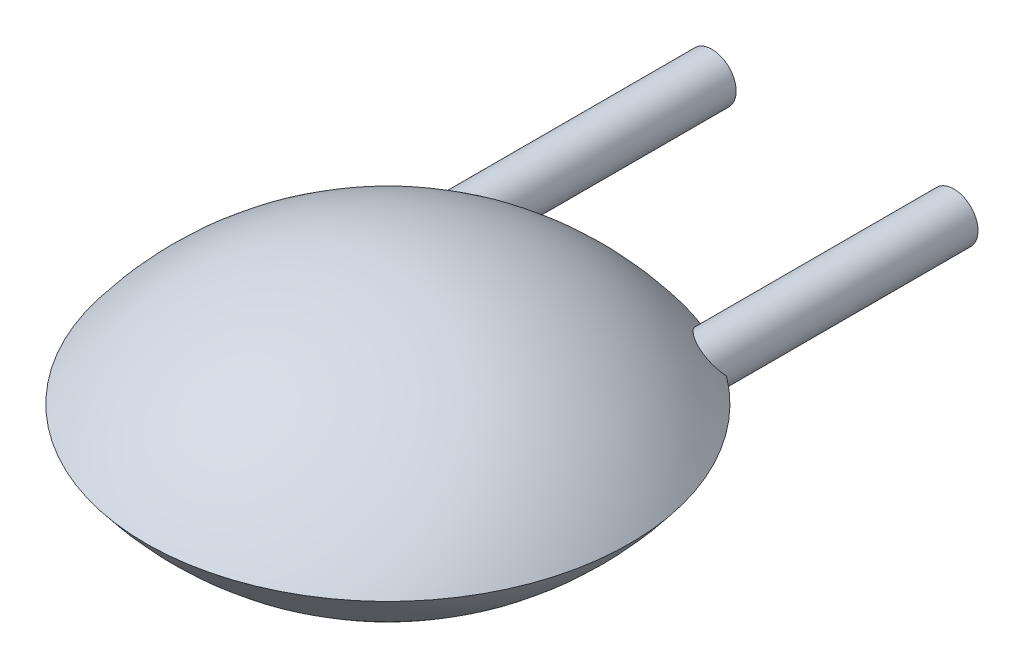
ISO-10303-21;
HEADER;
FILE_DESCRIPTION(('STEP AP214'),'2;1');
FILE_NAME('part.step','',(''),(''),'','','');
FILE_SCHEMA(('AUTOMOTIVE_DESIGN { 1 0 10303 214 1 1 1 1 }'));
ENDSEC;
DATA;
#1=APPLICATION_CONTEXT('core data for automotive mechanical design processes');
#2=APPLICATION_PROTOCOL_DEFINITION('international standard','automotive_design',2000,#1);
#3=PRODUCT_CONTEXT('',#1,'mechanical');
#4=PRODUCT('Part','Part','',(#3));
#5=PRODUCT_RELATED_PRODUCT_CATEGORY('part','',(#4));
#6=PRODUCT_DEFINITION_FORMATION('','',#4);
#7=PRODUCT_DEFINITION_CONTEXT('part definition',#1,'design');
#8=PRODUCT_DEFINITION('design','',#6,#7);
#9=PRODUCT_DEFINITION_SHAPE('','',#8);
#10=(LENGTH_UNIT() NAMED_UNIT(*) SI_UNIT(.MILLI.,.METRE.));
#11=(NAMED_UNIT(*) PLANE_ANGLE_UNIT() SI_UNIT($,.RADIAN.));
#12=(NAMED_UNIT(*) SI_UNIT($,.STERADIAN.) SOLID_ANGLE_UNIT());
#13=UNCERTAINTY_MEASURE_WITH_UNIT(LENGTH_MEASURE(1.E-05),#10,'distance_accuracy_value','');
#14=(GEOMETRIC_REPRESENTATION_CONTEXT(3) GLOBAL_UNCERTAINTY_ASSIGNED_CONTEXT((#13)) GLOBAL_UNIT_ASSIGNED_CONTEXT((#10,
#11,#12)) REPRESENTATION_CONTEXT('',''));
#15=CARTESIAN_POINT('',(0.,0.,0.));
#16=DIRECTION('',(0.,0.,1.));
#17=DIRECTION('',(1.,0.,0.));
#18=AXIS2_PLACEMENT_3D('',#15,#16,#17);
#19=CARTESIAN_POINT('',(2.755,0.25,-2.));
#20=DIRECTION('',(0.,0.,-1.));
#21=DIRECTION('',(0.,-1.,0.));
#22=AXIS2_PLACEMENT_3D('',#19,#20,#21);
#23=PLANE('',#22);
#24=CARTESIAN_POINT('',(2.5,-1.26661918800619E-13,-2.));
#25=DIRECTION('',(0.,0.,-1.));
#26=DIRECTION('',(-1.,0.,0.));
#27=AXIS2_PLACEMENT_3D('',#24,#25,#26);
#28=CIRCLE('',#27,0.249999999999979);
#29=CARTESIAN_POINT('',(2.25000000000002,-1.26661918800619E-13,-2.));
#30=VERTEX_POINT('',#29);
#31=EDGE_CURVE('E51',#30,#30,#28,.F.);
#32=ORIENTED_EDGE('',*,*,#31,.F.);
#33=EDGE_LOOP('',(#32));
#34=FACE_BOUND('',#33,.T.);
#35=ADVANCED_FACE('F17',(#34),#23,.T.);
#36=CARTESIAN_POINT('',(-0.255,-0.25,-2.));
#37=DIRECTION('',(0.,0.,-1.));
#38=DIRECTION('',(0.,1.,0.));
#39=AXIS2_PLACEMENT_3D('',#36,#37,#38);
#40=PLANE('',#39);
#41=CARTESIAN_POINT('',(0.,1.26580603637683E-13,-2.));
#42=DIRECTION('',(0.,0.,-1.));
#43=DIRECTION('',(-1.,0.,0.));
#44=AXIS2_PLACEMENT_3D('',#41,#42,#43);
#45=CIRCLE('',#44,0.249999999999979);
#46=CARTESIAN_POINT('',(-0.249999999999979,1.26580603637683E-13,-2.));
#47=VERTEX_POINT('',#46);
#48=EDGE_CURVE('E90',#47,#47,#45,.F.);
#49=ORIENTED_EDGE('',*,*,#48,.F.);
#50=EDGE_LOOP('',(#49));
#51=FACE_BOUND('',#50,.T.);
#52=ADVANCED_FACE('F87',(#51),#40,.T.);
#53=CARTESIAN_POINT('',(2.5,-1.26661918800619E-13,0.729876662499));
#54=DIRECTION('',(0.,0.,-1.));
#55=DIRECTION('',(-1.,0.,0.));
#56=AXIS2_PLACEMENT_3D('',#53,#54,#55);
#57=CYLINDRICAL_SURFACE('',#56,0.249999999999979);
#58=CARTESIAN_POINT('',(2.74999999999998,1.10598110046265E-13,0.600000000000105));
#59=CARTESIAN_POINT('',(2.74996831500516,0.0152953630539708,0.614307261235111));
#60=CARTESIAN_POINT('',(2.74858650443059,0.031069132342929,0.628397485276167));
#61=CARTESIAN_POINT('',(2.74241563227304,0.0633614647499166,0.655385017296721));
#62=CARTESIAN_POINT('',(2.73757398831808,0.0798877902622742,0.66826040049759));
#63=CARTESIAN_POINT('',(2.72684027747434,0.105546588593836,0.686327406929106));
#64=CARTESIAN_POINT('',(2.72239459439526,0.114669020400689,0.692374307778562));
#65=CARTESIAN_POINT('',(2.71211410354781,0.132721751452659,0.703414113960098));
#66=CARTESIAN_POINT('',(2.70628564248961,0.141652730997912,0.708411643755682));
#67=CARTESIAN_POINT('',(2.6941822339536,0.157727357116136,0.716365139998048));
#68=CARTESIAN_POINT('',(2.68811994009843,0.164931969807166,0.719518215902648));
#69=CARTESIAN_POINT('',(2.67496916543412,0.178821287038767,0.7246323398921));
#70=CARTESIAN_POINT('',(2.6678809088678,0.185506104700465,0.72659364797382));
#71=CARTESIAN_POINT('',(2.65277445487178,0.198134533471485,0.729154972080429));
#72=CARTESIAN_POINT('',(2.64475138803358,0.204073895209916,0.729747491719958));
#73=CARTESIAN_POINT('',(2.62806749270661,0.214936675441072,0.729487035437101));
#74=CARTESIAN_POINT('',(2.61940672773521,0.219860194930648,0.728634203291928));
#75=CARTESIAN_POINT('',(2.60256843545302,0.228166345186264,0.725711624186338));
#76=CARTESIAN_POINT('',(2.59441845320567,0.231648306776192,0.723759427238487));
#77=CARTESIAN_POINT('',(2.57806493413321,0.237659141657605,0.718877508051946));
#78=CARTESIAN_POINT('',(2.56986138065098,0.240187702594835,0.715947466042133));
#79=CARTESIAN_POINT('',(2.55111655290198,0.244962477245274,0.708276469800053));
#80=CARTESIAN_POINT('',(2.54061110523447,0.246897236480397,0.703255970411835));
#81=CARTESIAN_POINT('',(2.51998856476029,0.249416858689239,0.692188084747817));
#82=CARTESIAN_POINT('',(2.50987214879625,0.249999465171378,0.68613899997886));
#83=CARTESIAN_POINT('',(2.4821586852701,0.250000966561776,0.668101274239286));
#84=CARTESIAN_POINT('',(2.46511517309169,0.248100825191583,0.65525977920515));
#85=CARTESIAN_POINT('',(2.43280344181189,0.241367659280467,0.628186466608448));
#86=CARTESIAN_POINT('',(2.41754207496661,0.236523731819275,0.613949646372646));
#87=CARTESIAN_POINT('',(2.38476260927401,0.22275379214357,0.580565175806371));
#88=CARTESIAN_POINT('',(2.36782405961647,0.213061352044565,0.561165971981635));
#89=CARTESIAN_POINT('',(2.33696060599022,0.190482829774047,0.521857549280326));
#90=CARTESIAN_POINT('',(2.32303769647562,0.177594646043372,0.501948002552135));
#91=CARTESIAN_POINT('',(2.29815091626633,0.148751920045031,0.461726012037251));
#92=CARTESIAN_POINT('',(2.2872531473187,0.132740228530098,0.441413628118798));
#93=CARTESIAN_POINT('',(2.26926302727932,0.0981755640070862,0.401345191382363));
#94=CARTESIAN_POINT('',(2.26215835437199,0.0796310683943441,0.381587537169254));
#95=CARTESIAN_POINT('',(2.25495337454237,0.0504773630747672,0.35313256656374));
#96=CARTESIAN_POINT('',(2.25313049731494,0.0407118377338322,0.343989300033733));
#97=CARTESIAN_POINT('',(2.25065545697635,0.0207016797178923,0.326058287401227));
#98=CARTESIAN_POINT('',(2.25000446897692,0.0104565766935262,0.31727090678202));
#99=CARTESIAN_POINT('',(2.25000000000002,0.,0.308712152522103));
#100=B_SPLINE_CURVE_WITH_KNOTS('',3,(#58,#59,#60,#61,#62,#63,#64,#65,#66,#67,#68,#69,#70,#71,
#72,#73,#74,#75,#76,#77,#78,#79,#80,#81,#82,#83,#84,#85,#86,#87,#88,#89,#90,#91,#92,#93,#94,#95,
#96,#97,#98,#99),.UNSPECIFIED.,.F.,.F.,(4,2,2,2,2,2,2,2,2,2,2,2,2,2,2,2,2,2,2,2,4),(0.,
0.0631169965110015,0.127214219304128,0.162547660109247,0.19772196138693,0.227391076018448,
0.257053715689979,0.286878426235301,0.316700170124245,0.343813602857831,0.370935910824025,
0.406182541375689,0.441487949837896,0.505293198022049,0.569336214671407,0.651462563020561,
0.733643062538741,0.817498720668084,0.901080291432049,0.941528484933224,0.982017215308659),.UNSPECIFIED.);
#101=CARTESIAN_POINT('',(2.74999999999998,0.,0.599999999999925));
#102=VERTEX_POINT('',#101);
#103=CARTESIAN_POINT('',(2.25000000000002,0.,0.308712152522124));
#104=VERTEX_POINT('',#103);
#105=EDGE_CURVE('E52',#102,#104,#100,.T.);
#106=ORIENTED_EDGE('',*,*,#105,.F.);
#107=CARTESIAN_POINT('',(2.74999999999998,0.,0.599999999999928));
#108=CARTESIAN_POINT('',(2.74996831500519,-0.0152953630537775,0.614307261234947));
#109=CARTESIAN_POINT('',(2.74858650443064,-0.0310691323427305,0.628397485276018));
#110=CARTESIAN_POINT('',(2.74241563227316,-0.0633614647497012,0.655385017296599));
#111=CARTESIAN_POINT('',(2.73757398831824,-0.0798877902620471,0.668260400497483));
#112=CARTESIAN_POINT('',(2.72684027747456,-0.105546588593617,0.68632740692905));
#113=CARTESIAN_POINT('',(2.7223945943955,-0.114669020400487,0.692374307778533));
#114=CARTESIAN_POINT('',(2.71211410354807,-0.132721751452498,0.703414113960129));
#115=CARTESIAN_POINT('',(2.70628564248988,-0.141652730997774,0.708411643755745));
#116=CARTESIAN_POINT('',(2.69418223395388,-0.15772735711604,0.716365139998164));
#117=CARTESIAN_POINT('',(2.68811994009872,-0.164931969807089,0.719518215902787));
#118=CARTESIAN_POINT('',(2.67496916543443,-0.178821287038722,0.724632339892283));
#119=CARTESIAN_POINT('',(2.66788090886811,-0.185506104700434,0.726593647974025));
#120=CARTESIAN_POINT('',(2.65277445487211,-0.198134533471486,0.729154972080675));
#121=CARTESIAN_POINT('',(2.64475138803392,-0.204073895209935,0.729747491720224));
#122=CARTESIAN_POINT('',(2.62806749270694,-0.214936675441125,0.729487035437411));
#123=CARTESIAN_POINT('',(2.61940672773552,-0.219860194930715,0.728634203292258));
#124=CARTESIAN_POINT('',(2.60256843545332,-0.228166345186402,0.725711624186682));
#125=CARTESIAN_POINT('',(2.59441845320596,-0.231648306776382,0.723759427238826));
#126=CARTESIAN_POINT('',(2.57806493413348,-0.237659141657717,0.718877508052341));
#127=CARTESIAN_POINT('',(2.56986138065123,-0.240187702594819,0.715947466042593));
#128=CARTESIAN_POINT('',(2.55111655289833,-0.244962477246725,0.708276469798746));
#129=CARTESIAN_POINT('',(2.54061110522705,-0.246897236483079,0.703255970408097));
#130=CARTESIAN_POINT('',(2.51998856474469,-0.249416858689874,0.692188084739765));
#131=CARTESIAN_POINT('',(2.50987214877623,-0.249999465168716,0.686138999968918));
#132=CARTESIAN_POINT('',(2.48215868524657,-0.250000966554099,0.668101274226046));
#133=CARTESIAN_POINT('',(2.46511517306997,-0.248100825187097,0.655259779189424));
#134=CARTESIAN_POINT('',(2.43280344179273,-0.241367659276937,0.628186466590453));
#135=CARTESIAN_POINT('',(2.41754207494816,-0.236523731813532,0.613949646354896));
#136=CARTESIAN_POINT('',(2.38476260925645,-0.2227537921342,0.580565175787766));
#137=CARTESIAN_POINT('',(2.36782405959933,-0.213061352034087,0.561165971961759));
#138=CARTESIAN_POINT('',(2.33696060597393,-0.190482829760578,0.52185754925814));
#139=CARTESIAN_POINT('',(2.3230376964598,-0.177594646027992,0.501948002528908));
#140=CARTESIAN_POINT('',(2.29815091625208,-0.148751920025999,0.461726012012306));
#141=CARTESIAN_POINT('',(2.28725314730551,-0.13274022850936,0.441413628093178));
#142=CARTESIAN_POINT('',(2.26926302726884,-0.0981755639828915,0.401345191355763));
#143=CARTESIAN_POINT('',(2.26215835436313,-0.0796310683684121,0.381587537142346));
#144=CARTESIAN_POINT('',(2.25495337453765,-0.0504773630512487,0.353132566541518));
#145=CARTESIAN_POINT('',(2.25313049731194,-0.040711837714699,0.343989300016192));
#146=CARTESIAN_POINT('',(2.2506554569757,-0.0207016797080085,0.326058287392739));
#147=CARTESIAN_POINT('',(2.2500044689769,-0.0104565766885065,0.317270906777905));
#148=CARTESIAN_POINT('',(2.25000000000002,0.,0.308712152522146));
#149=B_SPLINE_CURVE_WITH_KNOTS('',3,(#107,#108,#109,#110,#111,#112,#113,#114,#115,#116,#117,
#118,#119,#120,#121,#122,#123,#124,#125,#126,#127,#128,#129,#130,#131,#132,#133,#134,#135,#136,
#137,#138,#139,#140,#141,#142,#143,#144,#145,#146,#147,#148),.UNSPECIFIED.,.F.,.F.,(4,2,2,2,2,2,
2,2,2,2,2,2,2,2,2,2,2,2,2,2,4),(0.,0.0631169965110145,0.127214219304117,0.162547660109303,
0.197721961387065,0.227391076018632,0.257053715690189,0.286878426235521,0.316700170124534,
0.343813602858168,0.370935910824307,0.406182541389356,0.441487949865298,0.505293198049375,
0.569336214697787,0.651462563050332,0.733643062572599,0.817498720705076,0.901080291471782,
0.941528484953319,0.982017215309143),.UNSPECIFIED.);
#150=EDGE_CURVE('E22',#102,#104,#149,.T.);
#151=ORIENTED_EDGE('',*,*,#150,.T.);
#152=EDGE_LOOP('',(#106,#151));
#153=FACE_BOUND('',#152,.T.);
#154=ORIENTED_EDGE('',*,*,#31,.T.);
#155=EDGE_LOOP('',(#154));
#156=FACE_BOUND('',#155,.T.);
#157=ADVANCED_FACE('F53',(#153,#156),#57,.T.);
#158=CARTESIAN_POINT('',(0.,1.26580603637683E-13,0.75717542912601));
#159=DIRECTION('',(0.,0.,-1.));
#160=DIRECTION('',(-1.,0.,0.));
#161=AXIS2_PLACEMENT_3D('',#158,#159,#160);
#162=CYLINDRICAL_SURFACE('',#161,0.249999999999979);
#163=ORIENTED_EDGE('',*,*,#48,.T.);
#164=EDGE_LOOP('',(#163));
#165=FACE_BOUND('',#164,.T.);
#166=CARTESIAN_POINT('',(0.249999999999979,0.,0.308712152522128));
#167=CARTESIAN_POINT('',(0.24997488827417,0.0164350278058691,0.322170932045068));
#168=CARTESIAN_POINT('',(0.24838247205631,0.0323369222718146,0.336174769257033));
#169=CARTESIAN_POINT('',(0.242477044037619,0.0628308969966721,0.364876576993245));
#170=CARTESIAN_POINT('',(0.238177189604652,0.0774289241226746,0.379570874299972));
#171=CARTESIAN_POINT('',(0.22648109296464,0.107225071677549,0.411530011764898));
#172=CARTESIAN_POINT('',(0.218729500903288,0.122209542447046,0.428861522547737));
#173=CARTESIAN_POINT('',(0.20053732745672,0.1502153658402,0.463802021452636));
#174=CARTESIAN_POINT('',(0.190087495283091,0.163229715559201,0.481411764528911));
#175=CARTESIAN_POINT('',(0.164389568525476,0.189413869016829,0.520068167811574));
#176=CARTESIAN_POINT('',(0.148599067962354,0.202087940462894,0.541093345876465));
#177=CARTESIAN_POINT('',(0.113678976252789,0.223600006324568,0.582298917255407));
#178=CARTESIAN_POINT('',(0.0945586897048824,0.232448457054781,0.602481475295789));
#179=CARTESIAN_POINT('',(0.062461220046027,0.242360358721125,0.632155175132091));
#180=CARTESIAN_POINT('',(0.0506411517246721,0.245134277478272,0.642336808562822));
#181=CARTESIAN_POINT('',(0.0260273410005417,0.248952701278427,0.661807685065618));
#182=CARTESIAN_POINT('',(0.013235409149073,0.250000343502062,0.671098517983417));
#183=CARTESIAN_POINT('',(-0.00972521836969655,0.249999747593806,0.686043793814974));
#184=CARTESIAN_POINT('',(-0.0196898760185911,0.249433673811248,0.692009157779902));
#185=CARTESIAN_POINT('',(-0.0400116863966989,0.24698925438735,0.702952047667072));
#186=CARTESIAN_POINT('',(-0.050368861781885,0.24511083288837,0.707929516464647));
#187=CARTESIAN_POINT('',(-0.0714039741564037,0.239833895112313,0.716616819844697));
#188=CARTESIAN_POINT('',(-0.0820842867621061,0.236417028315236,0.720310368380872));
#189=CARTESIAN_POINT('',(-0.103258241925344,0.227962289129029,0.725965816213216));
#190=CARTESIAN_POINT('',(-0.113752227064048,0.222927809133847,0.727931307572982));
#191=CARTESIAN_POINT('',(-0.132571724906299,0.21218983221923,0.729743482682907));
#192=CARTESIAN_POINT('',(-0.14098961249604,0.206692590899475,0.729858526972533));
#193=CARTESIAN_POINT('',(-0.157035621830107,0.194780894763749,0.728641414219702));
#194=CARTESIAN_POINT('',(-0.16466360041175,0.188366274182319,0.727308995340866));
#195=CARTESIAN_POINT('',(-0.178263161544856,0.175504578447866,0.723513113402477));
#196=CARTESIAN_POINT('',(-0.184322553719638,0.169114707800665,0.721164899251226));
#197=CARTESIAN_POINT('',(-0.195557679510187,0.155986827702102,0.715547001523279));
#198=CARTESIAN_POINT('',(-0.200733607726821,0.149248895345451,0.712277521295823));
#199=CARTESIAN_POINT('',(-0.212633692118618,0.13207929297612,0.703121400910278));
#200=CARTESIAN_POINT('',(-0.218798792475354,0.121518392854142,0.696750862256912));
#201=CARTESIAN_POINT('',(-0.229324849539542,0.100258995182404,0.682771236935766));
#202=CARTESIAN_POINT('',(-0.23367549079643,0.0895600580829835,0.675155402398183));
#203=CARTESIAN_POINT('',(-0.241731217808992,0.065353636228588,0.656884154774414));
#204=CARTESIAN_POINT('',(-0.244932257080227,0.0518803829260373,0.645967864175749));
#205=CARTESIAN_POINT('',(-0.249041748167463,0.0255134209676707,0.623424508816379));
#206=CARTESIAN_POINT('',(-0.249983191073556,0.0126141059630354,0.611810242781501));
#207=CARTESIAN_POINT('',(-0.249999999999979,0.,0.599999999999936));
#208=B_SPLINE_CURVE_WITH_KNOTS('',3,(#166,#167,#168,#169,#170,#171,#172,#173,#174,#175,#176,
#177,#178,#179,#180,#181,#182,#183,#184,#185,#186,#187,#188,#189,#190,#191,#192,#193,#194,#195,
#196,#197,#198,#199,#200,#201,#202,#203,#204,#205,#206,#207),.UNSPECIFIED.,.F.,.F.,(4,2,2,2,2,2,
2,2,2,2,2,2,2,2,2,2,2,2,2,2,4),(0.,0.0635606960040298,0.126814864473544,0.199131133621958,
0.271698706082204,0.358869301972328,0.445800110437347,0.493224944177046,0.540563496826684,
0.575347292216441,0.610133098380463,0.645345295909268,0.680484124598111,0.710471946812201,
0.740465194525611,0.767700910603585,0.794930619698631,0.836064929650409,0.877430006946458,
0.930136425300197,0.982068496416083),.UNSPECIFIED.);
#209=CARTESIAN_POINT('',(0.249999999999979,0.,0.30871215252214));
#210=VERTEX_POINT('',#209);
#211=CARTESIAN_POINT('',(-0.249999999999979,0.,0.600000000000017));
#212=VERTEX_POINT('',#211);
#213=EDGE_CURVE('E56',#210,#212,#208,.T.);
#214=ORIENTED_EDGE('',*,*,#213,.F.);
#215=CARTESIAN_POINT('',(0.249999999999979,0.,0.308712152522121));
#216=CARTESIAN_POINT('',(0.249974888274154,-0.0164350278058247,0.322170932045042));
#217=CARTESIAN_POINT('',(0.248382472056285,-0.0323369222717394,0.336174769256983));
#218=CARTESIAN_POINT('',(0.242477044037575,-0.0628308969965934,0.364876576993196));
#219=CARTESIAN_POINT('',(0.23817718960459,-0.0774289241226191,0.379570874299949));
#220=CARTESIAN_POINT('',(0.226481092964529,-0.107225071677535,0.41153001176494));
#221=CARTESIAN_POINT('',(0.218729500903145,-0.122209542447048,0.428861522547819));
#222=CARTESIAN_POINT('',(0.200537327456527,-0.150215365840209,0.463802021452727));
#223=CARTESIAN_POINT('',(0.190087495282888,-0.163229715559207,0.481411764528972));
#224=CARTESIAN_POINT('',(0.164389568525318,-0.189413869016675,0.520068167811563));
#225=CARTESIAN_POINT('',(0.148599067962265,-0.202087940462567,0.541093345876422));
#226=CARTESIAN_POINT('',(0.113678976252621,-0.223600006324547,0.582298917255236));
#227=CARTESIAN_POINT('',(0.0945586897045404,-0.232448457055212,0.602481475295516));
#228=CARTESIAN_POINT('',(0.0624612200425289,-0.242360358721636,0.632155175135228));
#229=CARTESIAN_POINT('',(0.0506411517177675,-0.245134277478733,0.642336808569032));
#230=CARTESIAN_POINT('',(0.0260273409856552,-0.24895270128084,0.661807685076097));
#231=CARTESIAN_POINT('',(0.0132354091296216,-0.250000343506487,0.671098517995103));
#232=CARTESIAN_POINT('',(-0.0097252183924076,-0.249999747595336,0.686043793827271));
#233=CARTESIAN_POINT('',(-0.0196898760400532,-0.249433673809999,0.69200915779163));
#234=CARTESIAN_POINT('',(-0.0400116864161638,-0.24698925438317,0.702952047676819));
#235=CARTESIAN_POINT('',(-0.0503688618006033,-0.245110832884032,0.707929516472976));
#236=CARTESIAN_POINT('',(-0.0714039741732074,-0.239833895107227,0.716616819850461));
#237=CARTESIAN_POINT('',(-0.0820842867777367,-0.236417028309561,0.720310368385497));
#238=CARTESIAN_POINT('',(-0.103258241938479,-0.227962289122716,0.725965816215711));
#239=CARTESIAN_POINT('',(-0.11375222707586,-0.222927809127488,0.72793130757449));
#240=CARTESIAN_POINT('',(-0.132571724916087,-0.21218983221285,0.729743482683008));
#241=CARTESIAN_POINT('',(-0.140989612505105,-0.206692590893013,0.72985852697208));
#242=CARTESIAN_POINT('',(-0.15703562183774,-0.194780894757309,0.728641414218326));
#243=CARTESIAN_POINT('',(-0.164663600418672,-0.188366274175982,0.727308995339118));
#244=CARTESIAN_POINT('',(-0.178263161550888,-0.175504578441486,0.723513113400095));
#245=CARTESIAN_POINT('',(-0.184322553725434,-0.169114707794093,0.7211648992485));
#246=CARTESIAN_POINT('',(-0.195557679515487,-0.155986827695203,0.715547001519908));
#247=CARTESIAN_POINT('',(-0.200733607731861,-0.149248895338416,0.712277521292153));
#248=CARTESIAN_POINT('',(-0.212633692123302,-0.132079292968367,0.703121400905682));
#249=CARTESIAN_POINT('',(-0.218798792479858,-0.121518392845815,0.696750862251649));
#250=CARTESIAN_POINT('',(-0.229324849543565,-0.100258995172993,0.68277123692917));
#251=CARTESIAN_POINT('',(-0.233675490800152,-0.0895600580730641,0.675155402390924));
#252=CARTESIAN_POINT('',(-0.241731217811112,-0.0653536362200209,0.656884154767508));
#253=CARTESIAN_POINT('',(-0.244932257081491,-0.0518803829193176,0.64596786417011));
#254=CARTESIAN_POINT('',(-0.249041748167667,-0.0255134209645097,0.623424508813515));
#255=CARTESIAN_POINT('',(-0.249983191073543,-0.0126141059615876,0.611810242780137));
#256=CARTESIAN_POINT('',(-0.249999999999979,-1.026915482402E-13,0.600000000000098));
#257=B_SPLINE_CURVE_WITH_KNOTS('',3,(#215,#216,#217,#218,#219,#220,#221,#222,#223,#224,#225,
#226,#227,#228,#229,#230,#231,#232,#233,#234,#235,#236,#237,#238,#239,#240,#241,#242,#243,#244,
#245,#246,#247,#248,#249,#250,#251,#252,#253,#254,#255,#256),.UNSPECIFIED.,.F.,.F.,(4,2,2,2,2,2,
2,2,2,2,2,2,2,2,2,2,2,2,2,2,4),(0.,0.0635606960039152,0.126814864473542,0.199131133622107,
0.271698706082271,0.358869301972089,0.445800110437416,0.493224944190717,0.540563496853543,
0.575347292239578,0.610133098400009,0.645345295925036,0.680484124610023,0.710471946822432,
0.740465194534217,0.76770091061239,0.794930619707625,0.836064929661393,0.877430006959432,
0.93013642530621,0.982068496415346),.UNSPECIFIED.);
#258=EDGE_CURVE('E47',#210,#212,#257,.T.);
#259=ORIENTED_EDGE('',*,*,#258,.T.);
#260=EDGE_LOOP('',(#214,#259));
#261=FACE_BOUND('',#260,.T.);
#262=ADVANCED_FACE('F73',(#165,#261),#162,.T.);
#263=CARTESIAN_POINT('',(1.25,-1.87499999999998,2.6));
#264=DIRECTION('',(0.,-1.,0.));
#265=DIRECTION('',(-1.,0.,0.));
#266=AXIS2_PLACEMENT_3D('',#263,#264,#265);
#267=SPHERICAL_SURFACE('',#266,3.12499999999998);
#268=CARTESIAN_POINT('',(1.25000000000011,0.,2.6));
#269=DIRECTION('',(0.,-1.,0.));
#270=DIRECTION('',(0.,0.,-1.));
#271=AXIS2_PLACEMENT_3D('',#268,#269,#270);
#272=CIRCLE('',#271,2.49999999999998);
#273=EDGE_CURVE('E11',#102,#212,#272,.T.);
#274=ORIENTED_EDGE('',*,*,#273,.F.);
#275=ORIENTED_EDGE('',*,*,#105,.T.);
#276=CARTESIAN_POINT('',(1.25000000000011,0.,2.6));
#277=DIRECTION('',(0.,-1.,0.));
#278=DIRECTION('',(0.,0.,-1.));
#279=AXIS2_PLACEMENT_3D('',#276,#277,#278);
#280=CIRCLE('',#279,2.49999999999998);
#281=EDGE_CURVE('E32',#210,#104,#280,.T.);
#282=ORIENTED_EDGE('',*,*,#281,.F.);
#283=ORIENTED_EDGE('',*,*,#213,.T.);
#284=EDGE_LOOP('',(#274,#275,#282,#283));
#285=FACE_BOUND('',#284,.T.);
#286=ADVANCED_FACE('F59',(#285),#267,.T.);
#287=CARTESIAN_POINT('',(1.25,1.87499999999998,2.6));
#288=DIRECTION('',(0.,-1.,0.));
#289=DIRECTION('',(-1.,0.,0.));
#290=AXIS2_PLACEMENT_3D('',#287,#288,#289);
#291=SPHERICAL_SURFACE('',#290,3.12499999999998);
#292=ORIENTED_EDGE('',*,*,#150,.F.);
#293=ORIENTED_EDGE('',*,*,#273,.T.);
#294=ORIENTED_EDGE('',*,*,#258,.F.);
#295=ORIENTED_EDGE('',*,*,#281,.T.);
#296=EDGE_LOOP('',(#292,#293,#294,#295));
#297=FACE_BOUND('',#296,.T.);
#298=ADVANCED_FACE('F19',(#297),#291,.T.);
#299=CLOSED_SHELL('',(#35,#52,#157,#262,#286,#298));
#300=MANIFOLD_SOLID_BREP('B1',#299);
#301=ADVANCED_BREP_SHAPE_REPRESENTATION('',(#18,#300),#14);
#302=SHAPE_DEFINITION_REPRESENTATION(#9,#301);
ENDSEC;
END-ISO-10303-21;
